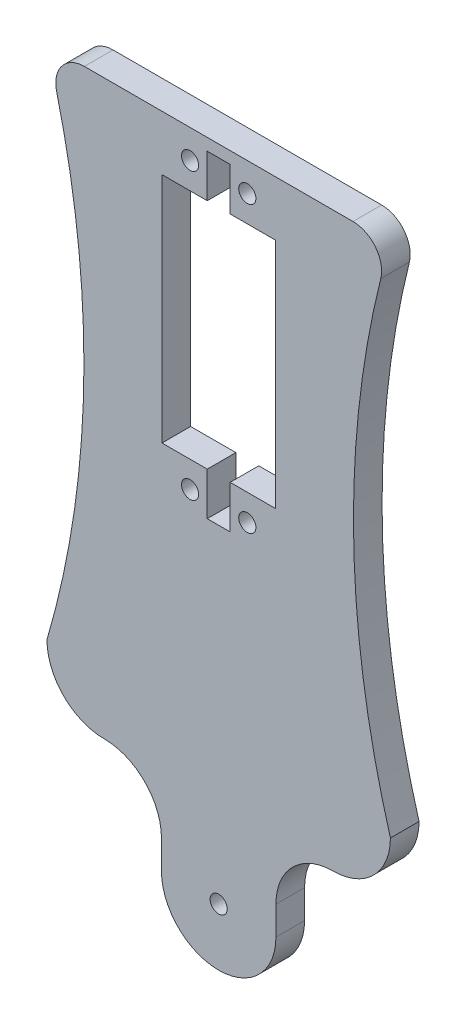
ISO-10303-21;
HEADER;
FILE_DESCRIPTION(('STEP AP214'),'2;1');
FILE_NAME('part.step','',(''),(''),'','','');
FILE_SCHEMA(('AUTOMOTIVE_DESIGN { 1 0 10303 214 1 1 1 1 }'));
ENDSEC;
DATA;
#1=APPLICATION_CONTEXT('core data for automotive mechanical design processes');
#2=APPLICATION_PROTOCOL_DEFINITION('international standard','automotive_design',2000,#1);
#3=PRODUCT_CONTEXT('',#1,'mechanical');
#4=PRODUCT('Part','Part','',(#3));
#5=PRODUCT_RELATED_PRODUCT_CATEGORY('part','',(#4));
#6=PRODUCT_DEFINITION_FORMATION('','',#4);
#7=PRODUCT_DEFINITION_CONTEXT('part definition',#1,'design');
#8=PRODUCT_DEFINITION('design','',#6,#7);
#9=PRODUCT_DEFINITION_SHAPE('','',#8);
#10=(LENGTH_UNIT() NAMED_UNIT(*) SI_UNIT(.MILLI.,.METRE.));
#11=(NAMED_UNIT(*) PLANE_ANGLE_UNIT() SI_UNIT($,.RADIAN.));
#12=(NAMED_UNIT(*) SI_UNIT($,.STERADIAN.) SOLID_ANGLE_UNIT());
#13=UNCERTAINTY_MEASURE_WITH_UNIT(LENGTH_MEASURE(1.E-05),#10,'distance_accuracy_value','');
#14=(GEOMETRIC_REPRESENTATION_CONTEXT(3) GLOBAL_UNCERTAINTY_ASSIGNED_CONTEXT((#13)) GLOBAL_UNIT_ASSIGNED_CONTEXT((#10,
#11,#12)) REPRESENTATION_CONTEXT('',''));
#15=CARTESIAN_POINT('',(0.,0.,0.));
#16=DIRECTION('',(0.,0.,1.));
#17=DIRECTION('',(1.,0.,0.));
#18=AXIS2_PLACEMENT_3D('',#15,#16,#17);
#19=CARTESIAN_POINT('',(-4.08966397750088,13.1353936637728,5.));
#20=DIRECTION('',(0.,0.,1.));
#21=DIRECTION('',(1.,0.,0.));
#22=AXIS2_PLACEMENT_3D('',#19,#20,#21);
#23=PLANE('',#22);
#24=DIRECTION('',(0.,-1.,0.));
#25=VECTOR('',#24,1.);
#26=CARTESIAN_POINT('',(-13.9896639775009,118.545393663773,5.));
#27=LINE('',#26,#25);
#28=CARTESIAN_POINT('',(-13.9896639775009,118.545393663773,5.));
#29=VERTEX_POINT('',#28);
#30=CARTESIAN_POINT('',(-13.9896639775009,77.9453936637728,5.));
#31=VERTEX_POINT('',#30);
#32=EDGE_CURVE('E50',#29,#31,#27,.T.);
#33=ORIENTED_EDGE('',*,*,#32,.F.);
#34=DIRECTION('',(-1.,0.,0.));
#35=VECTOR('',#34,1.);
#36=CARTESIAN_POINT('',(-13.9896639775009,118.545393663773,5.));
#37=LINE('',#36,#35);
#38=CARTESIAN_POINT('',(-6.08966397750088,118.545393663773,5.));
#39=VERTEX_POINT('',#38);
#40=EDGE_CURVE('E215',#39,#29,#37,.T.);
#41=ORIENTED_EDGE('',*,*,#40,.F.);
#42=DIRECTION('',(0.,-1.,0.));
#43=VECTOR('',#42,1.);
#44=CARTESIAN_POINT('',(-6.08966397750088,118.545393663773,5.));
#45=LINE('',#44,#43);
#46=CARTESIAN_POINT('',(-6.08966397750088,126.045393663773,5.));
#47=VERTEX_POINT('',#46);
#48=EDGE_CURVE('E218',#47,#39,#45,.T.);
#49=ORIENTED_EDGE('',*,*,#48,.F.);
#50=DIRECTION('',(-1.,0.,0.));
#51=VECTOR('',#50,1.);
#52=CARTESIAN_POINT('',(-2.08966397750088,126.045393663773,5.));
#53=LINE('',#52,#51);
#54=CARTESIAN_POINT('',(-2.08966397750088,126.045393663773,5.));
#55=VERTEX_POINT('',#54);
#56=EDGE_CURVE('E270',#55,#47,#53,.T.);
#57=ORIENTED_EDGE('',*,*,#56,.F.);
#58=DIRECTION('',(0.,1.,0.));
#59=VECTOR('',#58,1.);
#60=CARTESIAN_POINT('',(-2.08966397750088,118.545393663773,5.));
#61=LINE('',#60,#59);
#62=CARTESIAN_POINT('',(-2.08966397750088,118.545393663773,5.));
#63=VERTEX_POINT('',#62);
#64=EDGE_CURVE('E267',#63,#55,#61,.T.);
#65=ORIENTED_EDGE('',*,*,#64,.F.);
#66=DIRECTION('',(-1.,0.,0.));
#67=VECTOR('',#66,1.);
#68=CARTESIAN_POINT('',(-2.08966397750088,118.545393663773,5.));
#69=LINE('',#68,#67);
#70=CARTESIAN_POINT('',(5.81033602249911,118.545393663773,5.));
#71=VERTEX_POINT('',#70);
#72=EDGE_CURVE('E264',#71,#63,#69,.T.);
#73=ORIENTED_EDGE('',*,*,#72,.F.);
#74=DIRECTION('',(0.,1.,0.));
#75=VECTOR('',#74,1.);
#76=CARTESIAN_POINT('',(5.81033602249911,118.545393663773,5.));
#77=LINE('',#76,#75);
#78=CARTESIAN_POINT('',(5.81033602249911,77.9453936637728,5.));
#79=VERTEX_POINT('',#78);
#80=EDGE_CURVE('E261',#79,#71,#77,.T.);
#81=ORIENTED_EDGE('',*,*,#80,.F.);
#82=DIRECTION('',(1.,0.,0.));
#83=VECTOR('',#82,1.);
#84=CARTESIAN_POINT('',(-2.08966397750088,77.9453936637728,5.));
#85=LINE('',#84,#83);
#86=CARTESIAN_POINT('',(-2.08966397750088,77.9453936637728,5.));
#87=VERTEX_POINT('',#86);
#88=EDGE_CURVE('E258',#87,#79,#85,.T.);
#89=ORIENTED_EDGE('',*,*,#88,.F.);
#90=DIRECTION('',(0.,1.,0.));
#91=VECTOR('',#90,1.);
#92=CARTESIAN_POINT('',(-2.08966397750088,77.9453936637728,5.));
#93=LINE('',#92,#91);
#94=CARTESIAN_POINT('',(-2.08966397750088,70.4453936637728,5.));
#95=VERTEX_POINT('',#94);
#96=EDGE_CURVE('E255',#95,#87,#93,.T.);
#97=ORIENTED_EDGE('',*,*,#96,.F.);
#98=DIRECTION('',(1.,0.,0.));
#99=VECTOR('',#98,1.);
#100=CARTESIAN_POINT('',(-6.08966397750089,70.4453936637728,5.));
#101=LINE('',#100,#99);
#102=CARTESIAN_POINT('',(-6.08966397750089,70.4453936637728,5.));
#103=VERTEX_POINT('',#102);
#104=EDGE_CURVE('E252',#103,#95,#101,.T.);
#105=ORIENTED_EDGE('',*,*,#104,.F.);
#106=DIRECTION('',(0.,-1.,0.));
#107=VECTOR('',#106,1.);
#108=CARTESIAN_POINT('',(-6.08966397750089,77.9453936637728,5.));
#109=LINE('',#108,#107);
#110=CARTESIAN_POINT('',(-6.08966397750089,77.9453936637728,5.));
#111=VERTEX_POINT('',#110);
#112=EDGE_CURVE('E249',#111,#103,#109,.T.);
#113=ORIENTED_EDGE('',*,*,#112,.F.);
#114=DIRECTION('',(1.,0.,0.));
#115=VECTOR('',#114,1.);
#116=CARTESIAN_POINT('',(-13.9896639775009,77.9453936637728,5.));
#117=LINE('',#116,#115);
#118=EDGE_CURVE('E247',#31,#111,#117,.T.);
#119=ORIENTED_EDGE('',*,*,#118,.F.);
#120=EDGE_LOOP('',(#33,#41,#49,#57,#65,#73,#81,#89,#97,#105,#113,#119));
#121=FACE_BOUND('',#120,.T.);
#122=CARTESIAN_POINT('',(0.910336022499118,123.135393663773,5.));
#123=DIRECTION('',(0.,0.,1.));
#124=DIRECTION('',(1.,0.,0.));
#125=AXIS2_PLACEMENT_3D('',#122,#123,#124);
#126=CIRCLE('',#125,1.5);
#127=CARTESIAN_POINT('',(2.41033602249912,123.135393663773,5.));
#128=VERTEX_POINT('',#127);
#129=EDGE_CURVE('E301',#128,#128,#126,.T.);
#130=ORIENTED_EDGE('',*,*,#129,.F.);
#131=EDGE_LOOP('',(#130));
#132=FACE_BOUND('',#131,.T.);
#133=CARTESIAN_POINT('',(-9.08966397750089,73.3553936637728,5.));
#134=DIRECTION('',(0.,0.,1.));
#135=DIRECTION('',(1.,0.,0.));
#136=AXIS2_PLACEMENT_3D('',#133,#134,#135);
#137=CIRCLE('',#136,1.5);
#138=CARTESIAN_POINT('',(-7.58966397750089,73.3553936637728,5.));
#139=VERTEX_POINT('',#138);
#140=EDGE_CURVE('E307',#139,#139,#137,.T.);
#141=ORIENTED_EDGE('',*,*,#140,.F.);
#142=EDGE_LOOP('',(#141));
#143=FACE_BOUND('',#142,.T.);
#144=CARTESIAN_POINT('',(0.910336022499118,73.3553936637728,5.));
#145=DIRECTION('',(0.,0.,1.));
#146=DIRECTION('',(1.,0.,0.));
#147=AXIS2_PLACEMENT_3D('',#144,#145,#146);
#148=CIRCLE('',#147,1.5);
#149=CARTESIAN_POINT('',(2.41033602249912,73.3553936637728,5.));
#150=VERTEX_POINT('',#149);
#151=EDGE_CURVE('E277',#150,#150,#148,.T.);
#152=ORIENTED_EDGE('',*,*,#151,.F.);
#153=EDGE_LOOP('',(#152));
#154=FACE_BOUND('',#153,.T.);
#155=CARTESIAN_POINT('',(-9.08966397750088,123.135393663773,5.));
#156=DIRECTION('',(0.,0.,1.));
#157=DIRECTION('',(1.,0.,0.));
#158=AXIS2_PLACEMENT_3D('',#155,#156,#157);
#159=CIRCLE('',#158,1.5);
#160=CARTESIAN_POINT('',(-7.58966397750088,123.135393663773,5.));
#161=VERTEX_POINT('',#160);
#162=EDGE_CURVE('E300',#161,#161,#159,.T.);
#163=ORIENTED_EDGE('',*,*,#162,.F.);
#164=EDGE_LOOP('',(#163));
#165=FACE_BOUND('',#164,.T.);
#166=CARTESIAN_POINT('',(-4.08966397750088,13.1353936637728,5.));
#167=DIRECTION('',(0.,0.,1.));
#168=DIRECTION('',(1.,0.,0.));
#169=AXIS2_PLACEMENT_3D('',#166,#167,#168);
#170=CIRCLE('',#169,1.5);
#171=CARTESIAN_POINT('',(-2.58966397750088,13.1353936637728,5.));
#172=VERTEX_POINT('',#171);
#173=EDGE_CURVE('E337',#172,#172,#170,.T.);
#174=ORIENTED_EDGE('',*,*,#173,.F.);
#175=EDGE_LOOP('',(#174));
#176=FACE_BOUND('',#175,.T.);
#177=CARTESIAN_POINT('',(179.45186135034,83.1353936637728,5.));
#178=DIRECTION('',(0.,0.,1.));
#179=DIRECTION('',(1.,0.,0.));
#180=AXIS2_PLACEMENT_3D('',#177,#178,#179);
#181=CIRCLE('',#180,160.);
#182=CARTESIAN_POINT('',(25.9103360224991,38.1353936637728,5.));
#183=VERTEX_POINT('',#182);
#184=CARTESIAN_POINT('',(24.2246071095436,121.923272451652,5.));
#185=VERTEX_POINT('',#184);
#186=EDGE_CURVE('E318',#183,#185,#181,.F.);
#187=ORIENTED_EDGE('',*,*,#186,.T.);
#188=CARTESIAN_POINT('',(19.3737554145187,123.135393663773,5.));
#189=DIRECTION('',(0.,0.,1.));
#190=DIRECTION('',(1.,0.,0.));
#191=AXIS2_PLACEMENT_3D('',#188,#189,#190);
#192=CIRCLE('',#191,5.);
#193=CARTESIAN_POINT('',(19.3737554145187,128.135393663773,5.));
#194=VERTEX_POINT('',#193);
#195=EDGE_CURVE('E43',#185,#194,#192,.T.);
#196=ORIENTED_EDGE('',*,*,#195,.T.);
#197=DIRECTION('',(-1.,0.,0.));
#198=VECTOR('',#197,1.);
#199=CARTESIAN_POINT('',(-34.0896639775009,128.135393663773,5.));
#200=LINE('',#199,#198);
#201=CARTESIAN_POINT('',(-27.5530833695205,128.135393663773,5.));
#202=VERTEX_POINT('',#201);
#203=EDGE_CURVE('E348',#194,#202,#200,.T.);
#204=ORIENTED_EDGE('',*,*,#203,.T.);
#205=CARTESIAN_POINT('',(-27.5530833695205,123.135393663773,5.));
#206=DIRECTION('',(0.,0.,1.));
#207=DIRECTION('',(1.,0.,0.));
#208=AXIS2_PLACEMENT_3D('',#205,#206,#207);
#209=CIRCLE('',#208,5.);
#210=CARTESIAN_POINT('',(-32.4039350645454,121.923272451652,5.));
#211=VERTEX_POINT('',#210);
#212=EDGE_CURVE('E410',#202,#211,#209,.T.);
#213=ORIENTED_EDGE('',*,*,#212,.T.);
#214=CARTESIAN_POINT('',(-187.631189305342,83.1353936637728,5.));
#215=DIRECTION('',(0.,0.,1.));
#216=DIRECTION('',(1.,0.,0.));
#217=AXIS2_PLACEMENT_3D('',#214,#215,#216);
#218=CIRCLE('',#217,160.);
#219=CARTESIAN_POINT('',(-34.0896639775009,38.1353936637728,5.));
#220=VERTEX_POINT('',#219);
#221=EDGE_CURVE('E324',#220,#211,#218,.T.);
#222=ORIENTED_EDGE('',*,*,#221,.F.);
#223=CARTESIAN_POINT('',(-24.0896639775009,38.1353936637728,5.));
#224=DIRECTION('',(0.,0.,1.));
#225=DIRECTION('',(1.,0.,0.));
#226=AXIS2_PLACEMENT_3D('',#223,#224,#225);
#227=CIRCLE('',#226,10.);
#228=CARTESIAN_POINT('',(-24.0896639775009,28.1353936637728,5.));
#229=VERTEX_POINT('',#228);
#230=EDGE_CURVE('E378',#220,#229,#227,.T.);
#231=ORIENTED_EDGE('',*,*,#230,.T.);
#232=CARTESIAN_POINT('',(-24.0896639775009,18.1353936637728,5.));
#233=DIRECTION('',(0.,0.,1.));
#234=DIRECTION('',(1.,0.,0.));
#235=AXIS2_PLACEMENT_3D('',#232,#233,#234);
#236=CIRCLE('',#235,10.);
#237=CARTESIAN_POINT('',(-14.0896639775009,18.1353936637728,5.));
#238=VERTEX_POINT('',#237);
#239=EDGE_CURVE('E393',#229,#238,#236,.F.);
#240=ORIENTED_EDGE('',*,*,#239,.T.);
#241=DIRECTION('',(0.,-1.,0.));
#242=VECTOR('',#241,1.);
#243=CARTESIAN_POINT('',(-14.0896639775009,13.1353936637728,5.));
#244=LINE('',#243,#242);
#245=CARTESIAN_POINT('',(-14.0896639775009,13.1353936637728,5.));
#246=VERTEX_POINT('',#245);
#247=EDGE_CURVE('E351',#238,#246,#244,.T.);
#248=ORIENTED_EDGE('',*,*,#247,.T.);
#249=CARTESIAN_POINT('',(-4.08966397750088,13.1353936637728,5.));
#250=DIRECTION('',(0.,0.,1.));
#251=DIRECTION('',(1.,0.,0.));
#252=AXIS2_PLACEMENT_3D('',#249,#250,#251);
#253=CIRCLE('',#252,10.);
#254=CARTESIAN_POINT('',(5.91033602249912,13.1353936637728,5.));
#255=VERTEX_POINT('',#254);
#256=EDGE_CURVE('E341',#246,#255,#253,.T.);
#257=ORIENTED_EDGE('',*,*,#256,.T.);
#258=DIRECTION('',(0.,1.,0.));
#259=VECTOR('',#258,1.);
#260=CARTESIAN_POINT('',(5.91033602249912,13.1353936637728,5.));
#261=LINE('',#260,#259);
#262=CARTESIAN_POINT('',(5.91033602249912,18.1353936637728,5.));
#263=VERTEX_POINT('',#262);
#264=EDGE_CURVE('E344',#255,#263,#261,.T.);
#265=ORIENTED_EDGE('',*,*,#264,.T.);
#266=CARTESIAN_POINT('',(15.9103360224991,18.1353936637728,5.));
#267=DIRECTION('',(0.,0.,1.));
#268=DIRECTION('',(1.,0.,0.));
#269=AXIS2_PLACEMENT_3D('',#266,#267,#268);
#270=CIRCLE('',#269,10.);
#271=CARTESIAN_POINT('',(15.9103360224991,28.1353936637728,5.));
#272=VERTEX_POINT('',#271);
#273=EDGE_CURVE('E389',#263,#272,#270,.F.);
#274=ORIENTED_EDGE('',*,*,#273,.T.);
#275=CARTESIAN_POINT('',(15.9103360224991,38.1353936637728,5.));
#276=DIRECTION('',(0.,0.,1.));
#277=DIRECTION('',(1.,0.,0.));
#278=AXIS2_PLACEMENT_3D('',#275,#276,#277);
#279=CIRCLE('',#278,10.);
#280=EDGE_CURVE('E380',#272,#183,#279,.T.);
#281=ORIENTED_EDGE('',*,*,#280,.T.);
#282=EDGE_LOOP('',(#187,#196,#204,#213,#222,#231,#240,#248,#257,#265,#274,#281));
#283=FACE_BOUND('',#282,.T.);
#284=ADVANCED_FACE('F35',(#121,#132,#143,#154,#165,#176,#283),#23,.T.);
#285=CARTESIAN_POINT('',(-4.08966397750088,13.1353936637728,0.));
#286=DIRECTION('',(0.,0.,1.));
#287=DIRECTION('',(1.,0.,0.));
#288=AXIS2_PLACEMENT_3D('',#285,#286,#287);
#289=PLANE('',#288);
#290=DIRECTION('',(-1.,0.,0.));
#291=VECTOR('',#290,1.);
#292=CARTESIAN_POINT('',(-13.9896639775009,118.545393663773,0.));
#293=LINE('',#292,#291);
#294=CARTESIAN_POINT('',(-6.08966397750088,118.545393663773,0.));
#295=VERTEX_POINT('',#294);
#296=CARTESIAN_POINT('',(-13.9896639775009,118.545393663773,0.));
#297=VERTEX_POINT('',#296);
#298=EDGE_CURVE('E204',#295,#297,#293,.T.);
#299=ORIENTED_EDGE('',*,*,#298,.T.);
#300=DIRECTION('',(0.,-1.,0.));
#301=VECTOR('',#300,1.);
#302=CARTESIAN_POINT('',(-13.9896639775009,118.545393663773,0.));
#303=LINE('',#302,#301);
#304=CARTESIAN_POINT('',(-13.9896639775009,77.9453936637728,0.));
#305=VERTEX_POINT('',#304);
#306=EDGE_CURVE('E198',#297,#305,#303,.T.);
#307=ORIENTED_EDGE('',*,*,#306,.T.);
#308=DIRECTION('',(1.,0.,0.));
#309=VECTOR('',#308,1.);
#310=CARTESIAN_POINT('',(-13.9896639775009,77.9453936637728,0.));
#311=LINE('',#310,#309);
#312=CARTESIAN_POINT('',(-6.08966397750089,77.9453936637728,0.));
#313=VERTEX_POINT('',#312);
#314=EDGE_CURVE('E207',#305,#313,#311,.T.);
#315=ORIENTED_EDGE('',*,*,#314,.T.);
#316=DIRECTION('',(0.,-1.,0.));
#317=VECTOR('',#316,1.);
#318=CARTESIAN_POINT('',(-6.08966397750089,77.9453936637728,0.));
#319=LINE('',#318,#317);
#320=CARTESIAN_POINT('',(-6.08966397750089,70.4453936637728,0.));
#321=VERTEX_POINT('',#320);
#322=EDGE_CURVE('E58',#313,#321,#319,.T.);
#323=ORIENTED_EDGE('',*,*,#322,.T.);
#324=DIRECTION('',(1.,0.,0.));
#325=VECTOR('',#324,1.);
#326=CARTESIAN_POINT('',(-6.08966397750089,70.4453936637728,0.));
#327=LINE('',#326,#325);
#328=CARTESIAN_POINT('',(-2.08966397750088,70.4453936637728,0.));
#329=VERTEX_POINT('',#328);
#330=EDGE_CURVE('E222',#321,#329,#327,.T.);
#331=ORIENTED_EDGE('',*,*,#330,.T.);
#332=DIRECTION('',(0.,1.,0.));
#333=VECTOR('',#332,1.);
#334=CARTESIAN_POINT('',(-2.08966397750088,77.9453936637728,0.));
#335=LINE('',#334,#333);
#336=CARTESIAN_POINT('',(-2.08966397750088,77.9453936637728,0.));
#337=VERTEX_POINT('',#336);
#338=EDGE_CURVE('E225',#329,#337,#335,.T.);
#339=ORIENTED_EDGE('',*,*,#338,.T.);
#340=DIRECTION('',(1.,0.,0.));
#341=VECTOR('',#340,1.);
#342=CARTESIAN_POINT('',(-2.08966397750088,77.9453936637728,0.));
#343=LINE('',#342,#341);
#344=CARTESIAN_POINT('',(5.81033602249911,77.9453936637728,0.));
#345=VERTEX_POINT('',#344);
#346=EDGE_CURVE('E228',#337,#345,#343,.T.);
#347=ORIENTED_EDGE('',*,*,#346,.T.);
#348=DIRECTION('',(0.,1.,0.));
#349=VECTOR('',#348,1.);
#350=CARTESIAN_POINT('',(5.81033602249911,118.545393663773,0.));
#351=LINE('',#350,#349);
#352=CARTESIAN_POINT('',(5.81033602249911,118.545393663773,0.));
#353=VERTEX_POINT('',#352);
#354=EDGE_CURVE('E231',#345,#353,#351,.T.);
#355=ORIENTED_EDGE('',*,*,#354,.T.);
#356=DIRECTION('',(-1.,0.,0.));
#357=VECTOR('',#356,1.);
#358=CARTESIAN_POINT('',(-2.08966397750088,118.545393663773,0.));
#359=LINE('',#358,#357);
#360=CARTESIAN_POINT('',(-2.08966397750088,118.545393663773,0.));
#361=VERTEX_POINT('',#360);
#362=EDGE_CURVE('E234',#353,#361,#359,.T.);
#363=ORIENTED_EDGE('',*,*,#362,.T.);
#364=DIRECTION('',(0.,1.,0.));
#365=VECTOR('',#364,1.);
#366=CARTESIAN_POINT('',(-2.08966397750088,118.545393663773,0.));
#367=LINE('',#366,#365);
#368=CARTESIAN_POINT('',(-2.08966397750088,126.045393663773,0.));
#369=VERTEX_POINT('',#368);
#370=EDGE_CURVE('E237',#361,#369,#367,.T.);
#371=ORIENTED_EDGE('',*,*,#370,.T.);
#372=DIRECTION('',(-1.,0.,0.));
#373=VECTOR('',#372,1.);
#374=CARTESIAN_POINT('',(-2.08966397750088,126.045393663773,0.));
#375=LINE('',#374,#373);
#376=CARTESIAN_POINT('',(-6.08966397750088,126.045393663773,0.));
#377=VERTEX_POINT('',#376);
#378=EDGE_CURVE('E240',#369,#377,#375,.T.);
#379=ORIENTED_EDGE('',*,*,#378,.T.);
#380=DIRECTION('',(0.,-1.,0.));
#381=VECTOR('',#380,1.);
#382=CARTESIAN_POINT('',(-6.08966397750088,118.545393663773,0.));
#383=LINE('',#382,#381);
#384=EDGE_CURVE('E243',#377,#295,#383,.T.);
#385=ORIENTED_EDGE('',*,*,#384,.T.);
#386=EDGE_LOOP('',(#299,#307,#315,#323,#331,#339,#347,#355,#363,#371,#379,#385));
#387=FACE_BOUND('',#386,.T.);
#388=CARTESIAN_POINT('',(0.910336022499118,123.135393663773,0.));
#389=DIRECTION('',(0.,0.,1.));
#390=DIRECTION('',(1.,0.,0.));
#391=AXIS2_PLACEMENT_3D('',#388,#389,#390);
#392=CIRCLE('',#391,1.5);
#393=CARTESIAN_POINT('',(2.41033602249912,123.135393663773,0.));
#394=VERTEX_POINT('',#393);
#395=EDGE_CURVE('E297',#394,#394,#392,.T.);
#396=ORIENTED_EDGE('',*,*,#395,.T.);
#397=EDGE_LOOP('',(#396));
#398=FACE_BOUND('',#397,.T.);
#399=CARTESIAN_POINT('',(-9.08966397750089,73.3553936637728,0.));
#400=DIRECTION('',(0.,0.,1.));
#401=DIRECTION('',(1.,0.,0.));
#402=AXIS2_PLACEMENT_3D('',#399,#400,#401);
#403=CIRCLE('',#402,1.5);
#404=CARTESIAN_POINT('',(-7.58966397750089,73.3553936637728,0.));
#405=VERTEX_POINT('',#404);
#406=EDGE_CURVE('E304',#405,#405,#403,.T.);
#407=ORIENTED_EDGE('',*,*,#406,.T.);
#408=EDGE_LOOP('',(#407));
#409=FACE_BOUND('',#408,.T.);
#410=CARTESIAN_POINT('',(0.910336022499118,73.3553936637728,0.));
#411=DIRECTION('',(0.,0.,1.));
#412=DIRECTION('',(1.,0.,0.));
#413=AXIS2_PLACEMENT_3D('',#410,#411,#412);
#414=CIRCLE('',#413,1.5);
#415=CARTESIAN_POINT('',(2.41033602249912,73.3553936637728,0.));
#416=VERTEX_POINT('',#415);
#417=EDGE_CURVE('E310',#416,#416,#414,.T.);
#418=ORIENTED_EDGE('',*,*,#417,.T.);
#419=EDGE_LOOP('',(#418));
#420=FACE_BOUND('',#419,.T.);
#421=CARTESIAN_POINT('',(-9.08966397750088,123.135393663773,0.));
#422=DIRECTION('',(0.,0.,1.));
#423=DIRECTION('',(1.,0.,0.));
#424=AXIS2_PLACEMENT_3D('',#421,#422,#423);
#425=CIRCLE('',#424,1.5);
#426=CARTESIAN_POINT('',(-7.58966397750088,123.135393663773,0.));
#427=VERTEX_POINT('',#426);
#428=EDGE_CURVE('E315',#427,#427,#425,.T.);
#429=ORIENTED_EDGE('',*,*,#428,.T.);
#430=EDGE_LOOP('',(#429));
#431=FACE_BOUND('',#430,.T.);
#432=CARTESIAN_POINT('',(-4.08966397750088,13.1353936637728,0.));
#433=DIRECTION('',(0.,0.,1.));
#434=DIRECTION('',(1.,0.,0.));
#435=AXIS2_PLACEMENT_3D('',#432,#433,#434);
#436=CIRCLE('',#435,1.5);
#437=CARTESIAN_POINT('',(-2.58966397750088,13.1353936637728,0.));
#438=VERTEX_POINT('',#437);
#439=EDGE_CURVE('E333',#438,#438,#436,.T.);
#440=ORIENTED_EDGE('',*,*,#439,.T.);
#441=EDGE_LOOP('',(#440));
#442=FACE_BOUND('',#441,.T.);
#443=DIRECTION('',(-1.,0.,0.));
#444=VECTOR('',#443,1.);
#445=CARTESIAN_POINT('',(-34.0896639775009,128.135393663773,0.));
#446=LINE('',#445,#444);
#447=CARTESIAN_POINT('',(19.3737554145187,128.135393663773,0.));
#448=VERTEX_POINT('',#447);
#449=CARTESIAN_POINT('',(-27.5530833695205,128.135393663773,0.));
#450=VERTEX_POINT('',#449);
#451=EDGE_CURVE('E359',#448,#450,#446,.T.);
#452=ORIENTED_EDGE('',*,*,#451,.F.);
#453=CARTESIAN_POINT('',(19.3737554145187,123.135393663773,0.));
#454=DIRECTION('',(0.,0.,1.));
#455=DIRECTION('',(1.,0.,0.));
#456=AXIS2_PLACEMENT_3D('',#453,#454,#455);
#457=CIRCLE('',#456,5.);
#458=CARTESIAN_POINT('',(24.2246071095436,121.923272451652,0.));
#459=VERTEX_POINT('',#458);
#460=EDGE_CURVE('E406',#448,#459,#457,.F.);
#461=ORIENTED_EDGE('',*,*,#460,.T.);
#462=CARTESIAN_POINT('',(179.45186135034,83.1353936637728,0.));
#463=DIRECTION('',(0.,0.,1.));
#464=DIRECTION('',(1.,0.,0.));
#465=AXIS2_PLACEMENT_3D('',#462,#463,#464);
#466=CIRCLE('',#465,160.);
#467=CARTESIAN_POINT('',(25.9103360224991,38.1353936637728,0.));
#468=VERTEX_POINT('',#467);
#469=EDGE_CURVE('E321',#468,#459,#466,.F.);
#470=ORIENTED_EDGE('',*,*,#469,.F.);
#471=CARTESIAN_POINT('',(15.9103360224991,38.1353936637728,0.));
#472=DIRECTION('',(0.,0.,1.));
#473=DIRECTION('',(1.,0.,0.));
#474=AXIS2_PLACEMENT_3D('',#471,#472,#473);
#475=CIRCLE('',#474,10.);
#476=CARTESIAN_POINT('',(15.9103360224991,28.1353936637728,0.));
#477=VERTEX_POINT('',#476);
#478=EDGE_CURVE('E376',#468,#477,#475,.F.);
#479=ORIENTED_EDGE('',*,*,#478,.T.);
#480=CARTESIAN_POINT('',(15.9103360224991,18.1353936637728,0.));
#481=DIRECTION('',(0.,0.,1.));
#482=DIRECTION('',(1.,0.,0.));
#483=AXIS2_PLACEMENT_3D('',#480,#481,#482);
#484=CIRCLE('',#483,10.);
#485=CARTESIAN_POINT('',(5.91033602249912,18.1353936637728,0.));
#486=VERTEX_POINT('',#485);
#487=EDGE_CURVE('E387',#477,#486,#484,.T.);
#488=ORIENTED_EDGE('',*,*,#487,.T.);
#489=DIRECTION('',(0.,1.,0.));
#490=VECTOR('',#489,1.);
#491=CARTESIAN_POINT('',(5.91033602249912,13.1353936637728,0.));
#492=LINE('',#491,#490);
#493=CARTESIAN_POINT('',(5.91033602249912,13.1353936637728,0.));
#494=VERTEX_POINT('',#493);
#495=EDGE_CURVE('E356',#494,#486,#492,.T.);
#496=ORIENTED_EDGE('',*,*,#495,.F.);
#497=CARTESIAN_POINT('',(-4.08966397750088,13.1353936637728,0.));
#498=DIRECTION('',(0.,0.,1.));
#499=DIRECTION('',(1.,0.,0.));
#500=AXIS2_PLACEMENT_3D('',#497,#498,#499);
#501=CIRCLE('',#500,10.);
#502=CARTESIAN_POINT('',(-14.0896639775009,13.1353936637728,0.));
#503=VERTEX_POINT('',#502);
#504=EDGE_CURVE('E336',#503,#494,#501,.T.);
#505=ORIENTED_EDGE('',*,*,#504,.F.);
#506=DIRECTION('',(0.,-1.,0.));
#507=VECTOR('',#506,1.);
#508=CARTESIAN_POINT('',(-14.0896639775009,13.1353936637728,0.));
#509=LINE('',#508,#507);
#510=CARTESIAN_POINT('',(-14.0896639775009,18.1353936637728,0.));
#511=VERTEX_POINT('',#510);
#512=EDGE_CURVE('E345',#511,#503,#509,.T.);
#513=ORIENTED_EDGE('',*,*,#512,.F.);
#514=CARTESIAN_POINT('',(-24.0896639775009,18.1353936637728,0.));
#515=DIRECTION('',(0.,0.,1.));
#516=DIRECTION('',(1.,0.,0.));
#517=AXIS2_PLACEMENT_3D('',#514,#515,#516);
#518=CIRCLE('',#517,10.);
#519=CARTESIAN_POINT('',(-24.0896639775009,28.1353936637728,0.));
#520=VERTEX_POINT('',#519);
#521=EDGE_CURVE('E391',#511,#520,#518,.T.);
#522=ORIENTED_EDGE('',*,*,#521,.T.);
#523=CARTESIAN_POINT('',(-24.0896639775009,38.1353936637728,0.));
#524=DIRECTION('',(0.,0.,1.));
#525=DIRECTION('',(1.,0.,0.));
#526=AXIS2_PLACEMENT_3D('',#523,#524,#525);
#527=CIRCLE('',#526,10.);
#528=CARTESIAN_POINT('',(-34.0896639775009,38.1353936637728,0.));
#529=VERTEX_POINT('',#528);
#530=EDGE_CURVE('E373',#520,#529,#527,.F.);
#531=ORIENTED_EDGE('',*,*,#530,.T.);
#532=CARTESIAN_POINT('',(-187.631189305342,83.1353936637728,0.));
#533=DIRECTION('',(0.,0.,1.));
#534=DIRECTION('',(1.,0.,0.));
#535=AXIS2_PLACEMENT_3D('',#532,#533,#534);
#536=CIRCLE('',#535,160.);
#537=CARTESIAN_POINT('',(-32.4039350645454,121.923272451652,0.));
#538=VERTEX_POINT('',#537);
#539=EDGE_CURVE('E327',#529,#538,#536,.T.);
#540=ORIENTED_EDGE('',*,*,#539,.T.);
#541=CARTESIAN_POINT('',(-27.5530833695205,123.135393663773,0.));
#542=DIRECTION('',(0.,0.,1.));
#543=DIRECTION('',(1.,0.,0.));
#544=AXIS2_PLACEMENT_3D('',#541,#542,#543);
#545=CIRCLE('',#544,5.);
#546=EDGE_CURVE('E404',#538,#450,#545,.F.);
#547=ORIENTED_EDGE('',*,*,#546,.T.);
#548=EDGE_LOOP('',(#452,#461,#470,#479,#488,#496,#505,#513,#522,#531,#540,#547));
#549=FACE_BOUND('',#548,.T.);
#550=ADVANCED_FACE('F211',(#387,#398,#409,#420,#431,#442,#549),#289,.F.);
#551=CARTESIAN_POINT('',(-4.08966397750088,13.1353936637728,5.));
#552=DIRECTION('',(0.,0.,-1.));
#553=DIRECTION('',(-1.,0.,0.));
#554=AXIS2_PLACEMENT_3D('',#551,#552,#553);
#555=CYLINDRICAL_SURFACE('',#554,10.);
#556=ORIENTED_EDGE('',*,*,#504,.T.);
#557=DIRECTION('',(0.,0.,-1.));
#558=VECTOR('',#557,1.);
#559=CARTESIAN_POINT('',(5.91033602249912,13.1353936637728,5.));
#560=LINE('',#559,#558);
#561=EDGE_CURVE('E365',#255,#494,#560,.T.);
#562=ORIENTED_EDGE('',*,*,#561,.F.);
#563=ORIENTED_EDGE('',*,*,#256,.F.);
#564=DIRECTION('',(0.,0.,-1.));
#565=VECTOR('',#564,1.);
#566=CARTESIAN_POINT('',(-14.0896639775009,13.1353936637728,5.));
#567=LINE('',#566,#565);
#568=EDGE_CURVE('E353',#246,#503,#567,.T.);
#569=ORIENTED_EDGE('',*,*,#568,.T.);
#570=EDGE_LOOP('',(#556,#562,#563,#569));
#571=FACE_BOUND('',#570,.T.);
#572=ADVANCED_FACE('F445',(#571),#555,.T.);
#573=CARTESIAN_POINT('',(5.91033602249912,13.1353936637728,5.));
#574=DIRECTION('',(-1.,0.,0.));
#575=DIRECTION('',(0.,0.,1.));
#576=AXIS2_PLACEMENT_3D('',#573,#574,#575);
#577=PLANE('',#576);
#578=ORIENTED_EDGE('',*,*,#495,.T.);
#579=DIRECTION('',(0.,0.,-1.));
#580=VECTOR('',#579,1.);
#581=CARTESIAN_POINT('',(5.91033602249912,18.1353936637728,5.));
#582=LINE('',#581,#580);
#583=EDGE_CURVE('E368',#486,#263,#582,.F.);
#584=ORIENTED_EDGE('',*,*,#583,.T.);
#585=ORIENTED_EDGE('',*,*,#264,.F.);
#586=ORIENTED_EDGE('',*,*,#561,.T.);
#587=EDGE_LOOP('',(#578,#584,#585,#586));
#588=FACE_BOUND('',#587,.T.);
#589=ADVANCED_FACE('F438',(#588),#577,.F.);
#590=CARTESIAN_POINT('',(-34.0896639775009,128.135393663773,5.));
#591=DIRECTION('',(0.,-1.,0.));
#592=DIRECTION('',(0.,0.,-1.));
#593=AXIS2_PLACEMENT_3D('',#590,#591,#592);
#594=PLANE('',#593);
#595=ORIENTED_EDGE('',*,*,#203,.F.);
#596=DIRECTION('',(0.,0.,-1.));
#597=VECTOR('',#596,1.);
#598=CARTESIAN_POINT('',(19.3737554145187,128.135393663773,0.));
#599=LINE('',#598,#597);
#600=EDGE_CURVE('E401',#194,#448,#599,.T.);
#601=ORIENTED_EDGE('',*,*,#600,.T.);
#602=ORIENTED_EDGE('',*,*,#451,.T.);
#603=DIRECTION('',(0.,0.,1.));
#604=VECTOR('',#603,1.);
#605=CARTESIAN_POINT('',(-27.5530833695205,128.135393663773,5.));
#606=LINE('',#605,#604);
#607=EDGE_CURVE('E395',#450,#202,#606,.T.);
#608=ORIENTED_EDGE('',*,*,#607,.T.);
#609=EDGE_LOOP('',(#595,#601,#602,#608));
#610=FACE_BOUND('',#609,.T.);
#611=ADVANCED_FACE('F419',(#610),#594,.F.);
#612=CARTESIAN_POINT('',(-14.0896639775009,13.1353936637728,5.));
#613=DIRECTION('',(1.,0.,0.));
#614=DIRECTION('',(0.,0.,-1.));
#615=AXIS2_PLACEMENT_3D('',#612,#613,#614);
#616=PLANE('',#615);
#617=ORIENTED_EDGE('',*,*,#247,.F.);
#618=DIRECTION('',(0.,0.,-1.));
#619=VECTOR('',#618,1.);
#620=CARTESIAN_POINT('',(-14.0896639775009,18.1353936637728,0.));
#621=LINE('',#620,#619);
#622=EDGE_CURVE('E385',#238,#511,#621,.T.);
#623=ORIENTED_EDGE('',*,*,#622,.T.);
#624=ORIENTED_EDGE('',*,*,#512,.T.);
#625=ORIENTED_EDGE('',*,*,#568,.F.);
#626=EDGE_LOOP('',(#617,#623,#624,#625));
#627=FACE_BOUND('',#626,.T.);
#628=ADVANCED_FACE('F464',(#627),#616,.F.);
#629=CARTESIAN_POINT('',(-4.08966397750088,13.1353936637728,0.));
#630=DIRECTION('',(0.,0.,1.));
#631=DIRECTION('',(1.,0.,0.));
#632=AXIS2_PLACEMENT_3D('',#629,#630,#631);
#633=CYLINDRICAL_SURFACE('',#632,1.5);
#634=ORIENTED_EDGE('',*,*,#439,.F.);
#635=EDGE_LOOP('',(#634));
#636=FACE_BOUND('',#635,.T.);
#637=ORIENTED_EDGE('',*,*,#173,.T.);
#638=EDGE_LOOP('',(#637));
#639=FACE_BOUND('',#638,.T.);
#640=ADVANCED_FACE('F466',(#636,#639),#633,.F.);
#641=CARTESIAN_POINT('',(15.9103360224991,38.1353936637728,5.));
#642=DIRECTION('',(0.,0.,-1.));
#643=DIRECTION('',(-1.,0.,0.));
#644=AXIS2_PLACEMENT_3D('',#641,#642,#643);
#645=CYLINDRICAL_SURFACE('',#644,10.);
#646=DIRECTION('',(0.,0.,-1.));
#647=VECTOR('',#646,1.);
#648=CARTESIAN_POINT('',(25.9103360224991,38.1353936637728,5.));
#649=LINE('',#648,#647);
#650=EDGE_CURVE('E371',#183,#468,#649,.T.);
#651=ORIENTED_EDGE('',*,*,#650,.F.);
#652=ORIENTED_EDGE('',*,*,#280,.F.);
#653=DIRECTION('',(0.,0.,-1.));
#654=VECTOR('',#653,1.);
#655=CARTESIAN_POINT('',(15.9103360224991,28.1353936637728,5.));
#656=LINE('',#655,#654);
#657=EDGE_CURVE('E340',#477,#272,#656,.F.);
#658=ORIENTED_EDGE('',*,*,#657,.F.);
#659=ORIENTED_EDGE('',*,*,#478,.F.);
#660=EDGE_LOOP('',(#651,#652,#658,#659));
#661=FACE_BOUND('',#660,.T.);
#662=ADVANCED_FACE('F431',(#661),#645,.T.);
#663=CARTESIAN_POINT('',(15.9103360224991,18.1353936637728,5.));
#664=DIRECTION('',(0.,0.,1.));
#665=DIRECTION('',(1.,0.,0.));
#666=AXIS2_PLACEMENT_3D('',#663,#664,#665);
#667=CYLINDRICAL_SURFACE('',#666,10.);
#668=ORIENTED_EDGE('',*,*,#273,.F.);
#669=ORIENTED_EDGE('',*,*,#583,.F.);
#670=ORIENTED_EDGE('',*,*,#487,.F.);
#671=ORIENTED_EDGE('',*,*,#657,.T.);
#672=EDGE_LOOP('',(#668,#669,#670,#671));
#673=FACE_BOUND('',#672,.T.);
#674=ADVANCED_FACE('F440',(#673),#667,.F.);
#675=CARTESIAN_POINT('',(-24.0896639775009,18.1353936637728,5.));
#676=DIRECTION('',(0.,0.,1.));
#677=DIRECTION('',(1.,0.,0.));
#678=AXIS2_PLACEMENT_3D('',#675,#676,#677);
#679=CYLINDRICAL_SURFACE('',#678,10.);
#680=ORIENTED_EDGE('',*,*,#622,.F.);
#681=ORIENTED_EDGE('',*,*,#239,.F.);
#682=DIRECTION('',(0.,0.,-1.));
#683=VECTOR('',#682,1.);
#684=CARTESIAN_POINT('',(-24.0896639775009,28.1353936637728,5.));
#685=LINE('',#684,#683);
#686=EDGE_CURVE('E330',#520,#229,#685,.F.);
#687=ORIENTED_EDGE('',*,*,#686,.F.);
#688=ORIENTED_EDGE('',*,*,#521,.F.);
#689=EDGE_LOOP('',(#680,#681,#687,#688));
#690=FACE_BOUND('',#689,.T.);
#691=ADVANCED_FACE('F452',(#690),#679,.F.);
#692=CARTESIAN_POINT('',(-24.0896639775009,38.1353936637728,5.));
#693=DIRECTION('',(0.,0.,-1.));
#694=DIRECTION('',(-1.,0.,0.));
#695=AXIS2_PLACEMENT_3D('',#692,#693,#694);
#696=CYLINDRICAL_SURFACE('',#695,10.);
#697=ORIENTED_EDGE('',*,*,#230,.F.);
#698=DIRECTION('',(0.,0.,-1.));
#699=VECTOR('',#698,1.);
#700=CARTESIAN_POINT('',(-34.0896639775009,38.1353936637728,5.));
#701=LINE('',#700,#699);
#702=EDGE_CURVE('E383',#529,#220,#701,.F.);
#703=ORIENTED_EDGE('',*,*,#702,.F.);
#704=ORIENTED_EDGE('',*,*,#530,.F.);
#705=ORIENTED_EDGE('',*,*,#686,.T.);
#706=EDGE_LOOP('',(#697,#703,#704,#705));
#707=FACE_BOUND('',#706,.T.);
#708=ADVANCED_FACE('F458',(#707),#696,.T.);
#709=CARTESIAN_POINT('',(-187.631189305342,83.1353936637728,0.));
#710=DIRECTION('',(0.,0.,1.));
#711=DIRECTION('',(1.,0.,0.));
#712=AXIS2_PLACEMENT_3D('',#709,#710,#711);
#713=CYLINDRICAL_SURFACE('',#712,160.);
#714=ORIENTED_EDGE('',*,*,#221,.T.);
#715=DIRECTION('',(0.,0.,1.));
#716=VECTOR('',#715,1.);
#717=CARTESIAN_POINT('',(-32.4039350645454,121.923272451652,0.));
#718=LINE('',#717,#716);
#719=EDGE_CURVE('E11',#211,#538,#718,.F.);
#720=ORIENTED_EDGE('',*,*,#719,.T.);
#721=ORIENTED_EDGE('',*,*,#539,.F.);
#722=ORIENTED_EDGE('',*,*,#702,.T.);
#723=EDGE_LOOP('',(#714,#720,#721,#722));
#724=FACE_BOUND('',#723,.T.);
#725=ADVANCED_FACE('F460',(#724),#713,.F.);
#726=CARTESIAN_POINT('',(179.45186135034,83.1353936637728,0.));
#727=DIRECTION('',(0.,0.,1.));
#728=DIRECTION('',(1.,0.,0.));
#729=AXIS2_PLACEMENT_3D('',#726,#727,#728);
#730=CYLINDRICAL_SURFACE('',#729,160.);
#731=ORIENTED_EDGE('',*,*,#469,.T.);
#732=DIRECTION('',(0.,0.,1.));
#733=VECTOR('',#732,1.);
#734=CARTESIAN_POINT('',(24.2246071095436,121.923272451652,0.));
#735=LINE('',#734,#733);
#736=EDGE_CURVE('E408',#459,#185,#735,.T.);
#737=ORIENTED_EDGE('',*,*,#736,.T.);
#738=ORIENTED_EDGE('',*,*,#186,.F.);
#739=ORIENTED_EDGE('',*,*,#650,.T.);
#740=EDGE_LOOP('',(#731,#737,#738,#739));
#741=FACE_BOUND('',#740,.T.);
#742=ADVANCED_FACE('F427',(#741),#730,.F.);
#743=CARTESIAN_POINT('',(-9.08966397750088,123.135393663773,0.));
#744=DIRECTION('',(0.,0.,1.));
#745=DIRECTION('',(1.,0.,0.));
#746=AXIS2_PLACEMENT_3D('',#743,#744,#745);
#747=CYLINDRICAL_SURFACE('',#746,1.5);
#748=ORIENTED_EDGE('',*,*,#428,.F.);
#749=EDGE_LOOP('',(#748));
#750=FACE_BOUND('',#749,.T.);
#751=ORIENTED_EDGE('',*,*,#162,.T.);
#752=EDGE_LOOP('',(#751));
#753=FACE_BOUND('',#752,.T.);
#754=ADVANCED_FACE('F488',(#750,#753),#747,.F.);
#755=CARTESIAN_POINT('',(0.910336022499118,73.3553936637728,0.));
#756=DIRECTION('',(0.,0.,1.));
#757=DIRECTION('',(1.,0.,0.));
#758=AXIS2_PLACEMENT_3D('',#755,#756,#757);
#759=CYLINDRICAL_SURFACE('',#758,1.5);
#760=ORIENTED_EDGE('',*,*,#417,.F.);
#761=EDGE_LOOP('',(#760));
#762=FACE_BOUND('',#761,.T.);
#763=ORIENTED_EDGE('',*,*,#151,.T.);
#764=EDGE_LOOP('',(#763));
#765=FACE_BOUND('',#764,.T.);
#766=ADVANCED_FACE('F491',(#762,#765),#759,.F.);
#767=CARTESIAN_POINT('',(-9.08966397750089,73.3553936637728,0.));
#768=DIRECTION('',(0.,0.,1.));
#769=DIRECTION('',(1.,0.,0.));
#770=AXIS2_PLACEMENT_3D('',#767,#768,#769);
#771=CYLINDRICAL_SURFACE('',#770,1.5);
#772=ORIENTED_EDGE('',*,*,#406,.F.);
#773=EDGE_LOOP('',(#772));
#774=FACE_BOUND('',#773,.T.);
#775=ORIENTED_EDGE('',*,*,#140,.T.);
#776=EDGE_LOOP('',(#775));
#777=FACE_BOUND('',#776,.T.);
#778=ADVANCED_FACE('F495',(#774,#777),#771,.F.);
#779=CARTESIAN_POINT('',(0.910336022499118,123.135393663773,0.));
#780=DIRECTION('',(0.,0.,1.));
#781=DIRECTION('',(1.,0.,0.));
#782=AXIS2_PLACEMENT_3D('',#779,#780,#781);
#783=CYLINDRICAL_SURFACE('',#782,1.5);
#784=ORIENTED_EDGE('',*,*,#395,.F.);
#785=EDGE_LOOP('',(#784));
#786=FACE_BOUND('',#785,.T.);
#787=ORIENTED_EDGE('',*,*,#129,.T.);
#788=EDGE_LOOP('',(#787));
#789=FACE_BOUND('',#788,.T.);
#790=ADVANCED_FACE('F499',(#786,#789),#783,.F.);
#791=CARTESIAN_POINT('',(19.3737554145187,123.135393663773,0.));
#792=DIRECTION('',(0.,0.,1.));
#793=DIRECTION('',(1.,0.,0.));
#794=AXIS2_PLACEMENT_3D('',#791,#792,#793);
#795=CYLINDRICAL_SURFACE('',#794,5.);
#796=ORIENTED_EDGE('',*,*,#195,.F.);
#797=ORIENTED_EDGE('',*,*,#736,.F.);
#798=ORIENTED_EDGE('',*,*,#460,.F.);
#799=ORIENTED_EDGE('',*,*,#600,.F.);
#800=EDGE_LOOP('',(#796,#797,#798,#799));
#801=FACE_BOUND('',#800,.T.);
#802=ADVANCED_FACE('F422',(#801),#795,.T.);
#803=CARTESIAN_POINT('',(-27.5530833695205,123.135393663773,0.));
#804=DIRECTION('',(0.,0.,1.));
#805=DIRECTION('',(1.,0.,0.));
#806=AXIS2_PLACEMENT_3D('',#803,#804,#805);
#807=CYLINDRICAL_SURFACE('',#806,5.);
#808=ORIENTED_EDGE('',*,*,#212,.F.);
#809=ORIENTED_EDGE('',*,*,#607,.F.);
#810=ORIENTED_EDGE('',*,*,#546,.F.);
#811=ORIENTED_EDGE('',*,*,#719,.F.);
#812=EDGE_LOOP('',(#808,#809,#810,#811));
#813=FACE_BOUND('',#812,.T.);
#814=ADVANCED_FACE('F37',(#813),#807,.T.);
#815=CARTESIAN_POINT('',(-13.9896639775009,118.545393663773,0.));
#816=DIRECTION('',(-1.,0.,0.));
#817=DIRECTION('',(0.,-1.,0.));
#818=AXIS2_PLACEMENT_3D('',#815,#816,#817);
#819=PLANE('',#818);
#820=ORIENTED_EDGE('',*,*,#32,.T.);
#821=DIRECTION('',(0.,0.,1.));
#822=VECTOR('',#821,1.);
#823=CARTESIAN_POINT('',(-13.9896639775009,77.9453936637728,0.));
#824=LINE('',#823,#822);
#825=EDGE_CURVE('E194',#305,#31,#824,.T.);
#826=ORIENTED_EDGE('',*,*,#825,.F.);
#827=ORIENTED_EDGE('',*,*,#306,.F.);
#828=DIRECTION('',(0.,0.,1.));
#829=VECTOR('',#828,1.);
#830=CARTESIAN_POINT('',(-13.9896639775009,118.545393663773,0.));
#831=LINE('',#830,#829);
#832=EDGE_CURVE('E275',#297,#29,#831,.T.);
#833=ORIENTED_EDGE('',*,*,#832,.T.);
#834=EDGE_LOOP('',(#820,#826,#827,#833));
#835=FACE_BOUND('',#834,.T.);
#836=ADVANCED_FACE('F196',(#835),#819,.F.);
#837=CARTESIAN_POINT('',(-13.9896639775009,118.545393663773,0.));
#838=DIRECTION('',(0.,1.,0.));
#839=DIRECTION('',(0.,0.,1.));
#840=AXIS2_PLACEMENT_3D('',#837,#838,#839);
#841=PLANE('',#840);
#842=ORIENTED_EDGE('',*,*,#40,.T.);
#843=ORIENTED_EDGE('',*,*,#832,.F.);
#844=ORIENTED_EDGE('',*,*,#298,.F.);
#845=DIRECTION('',(0.,0.,1.));
#846=VECTOR('',#845,1.);
#847=CARTESIAN_POINT('',(-6.08966397750088,118.545393663773,0.));
#848=LINE('',#847,#846);
#849=EDGE_CURVE('E278',#295,#39,#848,.T.);
#850=ORIENTED_EDGE('',*,*,#849,.T.);
#851=EDGE_LOOP('',(#842,#843,#844,#850));
#852=FACE_BOUND('',#851,.T.);
#853=ADVANCED_FACE('F506',(#852),#841,.F.);
#854=CARTESIAN_POINT('',(-6.08966397750088,118.545393663773,0.));
#855=DIRECTION('',(-1.,0.,0.));
#856=DIRECTION('',(0.,0.,1.));
#857=AXIS2_PLACEMENT_3D('',#854,#855,#856);
#858=PLANE('',#857);
#859=ORIENTED_EDGE('',*,*,#48,.T.);
#860=ORIENTED_EDGE('',*,*,#849,.F.);
#861=ORIENTED_EDGE('',*,*,#384,.F.);
#862=DIRECTION('',(0.,0.,1.));
#863=VECTOR('',#862,1.);
#864=CARTESIAN_POINT('',(-6.08966397750088,126.045393663773,0.));
#865=LINE('',#864,#863);
#866=EDGE_CURVE('E280',#377,#47,#865,.T.);
#867=ORIENTED_EDGE('',*,*,#866,.T.);
#868=EDGE_LOOP('',(#859,#860,#861,#867));
#869=FACE_BOUND('',#868,.T.);
#870=ADVANCED_FACE('F539',(#869),#858,.F.);
#871=CARTESIAN_POINT('',(-2.08966397750088,126.045393663773,0.));
#872=DIRECTION('',(0.,1.,0.));
#873=DIRECTION('',(0.,0.,1.));
#874=AXIS2_PLACEMENT_3D('',#871,#872,#873);
#875=PLANE('',#874);
#876=ORIENTED_EDGE('',*,*,#56,.T.);
#877=ORIENTED_EDGE('',*,*,#866,.F.);
#878=ORIENTED_EDGE('',*,*,#378,.F.);
#879=DIRECTION('',(0.,0.,1.));
#880=VECTOR('',#879,1.);
#881=CARTESIAN_POINT('',(-2.08966397750088,126.045393663773,0.));
#882=LINE('',#881,#880);
#883=EDGE_CURVE('E282',#369,#55,#882,.T.);
#884=ORIENTED_EDGE('',*,*,#883,.T.);
#885=EDGE_LOOP('',(#876,#877,#878,#884));
#886=FACE_BOUND('',#885,.T.);
#887=ADVANCED_FACE('F535',(#886),#875,.F.);
#888=CARTESIAN_POINT('',(-2.08966397750088,118.545393663773,0.));
#889=DIRECTION('',(1.,0.,0.));
#890=DIRECTION('',(0.,0.,-1.));
#891=AXIS2_PLACEMENT_3D('',#888,#889,#890);
#892=PLANE('',#891);
#893=ORIENTED_EDGE('',*,*,#64,.T.);
#894=ORIENTED_EDGE('',*,*,#883,.F.);
#895=ORIENTED_EDGE('',*,*,#370,.F.);
#896=DIRECTION('',(0.,0.,1.));
#897=VECTOR('',#896,1.);
#898=CARTESIAN_POINT('',(-2.08966397750088,118.545393663773,0.));
#899=LINE('',#898,#897);
#900=EDGE_CURVE('E284',#361,#63,#899,.T.);
#901=ORIENTED_EDGE('',*,*,#900,.T.);
#902=EDGE_LOOP('',(#893,#894,#895,#901));
#903=FACE_BOUND('',#902,.T.);
#904=ADVANCED_FACE('F531',(#903),#892,.F.);
#905=CARTESIAN_POINT('',(-2.08966397750088,118.545393663773,0.));
#906=DIRECTION('',(0.,1.,0.));
#907=DIRECTION('',(0.,0.,1.));
#908=AXIS2_PLACEMENT_3D('',#905,#906,#907);
#909=PLANE('',#908);
#910=ORIENTED_EDGE('',*,*,#72,.T.);
#911=ORIENTED_EDGE('',*,*,#900,.F.);
#912=ORIENTED_EDGE('',*,*,#362,.F.);
#913=DIRECTION('',(0.,0.,1.));
#914=VECTOR('',#913,1.);
#915=CARTESIAN_POINT('',(5.81033602249911,118.545393663773,0.));
#916=LINE('',#915,#914);
#917=EDGE_CURVE('E286',#353,#71,#916,.T.);
#918=ORIENTED_EDGE('',*,*,#917,.T.);
#919=EDGE_LOOP('',(#910,#911,#912,#918));
#920=FACE_BOUND('',#919,.T.);
#921=ADVANCED_FACE('F527',(#920),#909,.F.);
#922=CARTESIAN_POINT('',(5.81033602249911,118.545393663773,0.));
#923=DIRECTION('',(1.,0.,0.));
#924=DIRECTION('',(0.,1.,0.));
#925=AXIS2_PLACEMENT_3D('',#922,#923,#924);
#926=PLANE('',#925);
#927=ORIENTED_EDGE('',*,*,#80,.T.);
#928=ORIENTED_EDGE('',*,*,#917,.F.);
#929=ORIENTED_EDGE('',*,*,#354,.F.);
#930=DIRECTION('',(0.,0.,1.));
#931=VECTOR('',#930,1.);
#932=CARTESIAN_POINT('',(5.81033602249911,77.9453936637728,0.));
#933=LINE('',#932,#931);
#934=EDGE_CURVE('E288',#345,#79,#933,.T.);
#935=ORIENTED_EDGE('',*,*,#934,.T.);
#936=EDGE_LOOP('',(#927,#928,#929,#935));
#937=FACE_BOUND('',#936,.T.);
#938=ADVANCED_FACE('F523',(#937),#926,.F.);
#939=CARTESIAN_POINT('',(-2.08966397750088,77.9453936637728,0.));
#940=DIRECTION('',(0.,-1.,0.));
#941=DIRECTION('',(0.,0.,-1.));
#942=AXIS2_PLACEMENT_3D('',#939,#940,#941);
#943=PLANE('',#942);
#944=ORIENTED_EDGE('',*,*,#88,.T.);
#945=ORIENTED_EDGE('',*,*,#934,.F.);
#946=ORIENTED_EDGE('',*,*,#346,.F.);
#947=DIRECTION('',(0.,0.,1.));
#948=VECTOR('',#947,1.);
#949=CARTESIAN_POINT('',(-2.08966397750088,77.9453936637728,0.));
#950=LINE('',#949,#948);
#951=EDGE_CURVE('E290',#337,#87,#950,.T.);
#952=ORIENTED_EDGE('',*,*,#951,.T.);
#953=EDGE_LOOP('',(#944,#945,#946,#952));
#954=FACE_BOUND('',#953,.T.);
#955=ADVANCED_FACE('F519',(#954),#943,.F.);
#956=CARTESIAN_POINT('',(-2.08966397750088,77.9453936637728,0.));
#957=DIRECTION('',(1.,0.,0.));
#958=DIRECTION('',(0.,1.,0.));
#959=AXIS2_PLACEMENT_3D('',#956,#957,#958);
#960=PLANE('',#959);
#961=ORIENTED_EDGE('',*,*,#96,.T.);
#962=ORIENTED_EDGE('',*,*,#951,.F.);
#963=ORIENTED_EDGE('',*,*,#338,.F.);
#964=DIRECTION('',(0.,0.,1.));
#965=VECTOR('',#964,1.);
#966=CARTESIAN_POINT('',(-2.08966397750088,70.4453936637728,0.));
#967=LINE('',#966,#965);
#968=EDGE_CURVE('E292',#329,#95,#967,.T.);
#969=ORIENTED_EDGE('',*,*,#968,.T.);
#970=EDGE_LOOP('',(#961,#962,#963,#969));
#971=FACE_BOUND('',#970,.T.);
#972=ADVANCED_FACE('F515',(#971),#960,.F.);
#973=CARTESIAN_POINT('',(-6.08966397750089,70.4453936637728,0.));
#974=DIRECTION('',(0.,-1.,0.));
#975=DIRECTION('',(0.,0.,-1.));
#976=AXIS2_PLACEMENT_3D('',#973,#974,#975);
#977=PLANE('',#976);
#978=ORIENTED_EDGE('',*,*,#104,.T.);
#979=ORIENTED_EDGE('',*,*,#968,.F.);
#980=ORIENTED_EDGE('',*,*,#330,.F.);
#981=DIRECTION('',(0.,0.,1.));
#982=VECTOR('',#981,1.);
#983=CARTESIAN_POINT('',(-6.08966397750089,70.4453936637728,0.));
#984=LINE('',#983,#982);
#985=EDGE_CURVE('E294',#321,#103,#984,.T.);
#986=ORIENTED_EDGE('',*,*,#985,.T.);
#987=EDGE_LOOP('',(#978,#979,#980,#986));
#988=FACE_BOUND('',#987,.T.);
#989=ADVANCED_FACE('F512',(#988),#977,.F.);
#990=CARTESIAN_POINT('',(-6.08966397750089,77.9453936637728,0.));
#991=DIRECTION('',(-1.,0.,0.));
#992=DIRECTION('',(0.,-1.,0.));
#993=AXIS2_PLACEMENT_3D('',#990,#991,#992);
#994=PLANE('',#993);
#995=ORIENTED_EDGE('',*,*,#112,.T.);
#996=ORIENTED_EDGE('',*,*,#985,.F.);
#997=ORIENTED_EDGE('',*,*,#322,.F.);
#998=DIRECTION('',(0.,0.,1.));
#999=VECTOR('',#998,1.);
#1000=CARTESIAN_POINT('',(-6.08966397750089,77.9453936637728,0.));
#1001=LINE('',#1000,#999);
#1002=EDGE_CURVE('E203',#313,#111,#1001,.T.);
#1003=ORIENTED_EDGE('',*,*,#1002,.T.);
#1004=EDGE_LOOP('',(#995,#996,#997,#1003));
#1005=FACE_BOUND('',#1004,.T.);
#1006=ADVANCED_FACE('F509',(#1005),#994,.F.);
#1007=CARTESIAN_POINT('',(-13.9896639775009,77.9453936637728,0.));
#1008=DIRECTION('',(0.,-1.,0.));
#1009=DIRECTION('',(0.,0.,-1.));
#1010=AXIS2_PLACEMENT_3D('',#1007,#1008,#1009);
#1011=PLANE('',#1010);
#1012=ORIENTED_EDGE('',*,*,#118,.T.);
#1013=ORIENTED_EDGE('',*,*,#1002,.F.);
#1014=ORIENTED_EDGE('',*,*,#314,.F.);
#1015=ORIENTED_EDGE('',*,*,#825,.T.);
#1016=EDGE_LOOP('',(#1012,#1013,#1014,#1015));
#1017=FACE_BOUND('',#1016,.T.);
#1018=ADVANCED_FACE('F208',(#1017),#1011,.F.);
#1019=CLOSED_SHELL('',(#284,#550,#572,#589,#611,#628,#640,#662,#674,#691,#708,#725,#742,#754,
#766,#778,#790,#802,#814,#836,#853,#870,#887,#904,#921,#938,#955,#972,#989,#1006,#1018));
#1020=MANIFOLD_SOLID_BREP('B2',#1019);
#1021=ADVANCED_BREP_SHAPE_REPRESENTATION('',(#18,#1020),#14);
#1022=SHAPE_DEFINITION_REPRESENTATION(#9,#1021);
ENDSEC;
END-ISO-10303-21;
